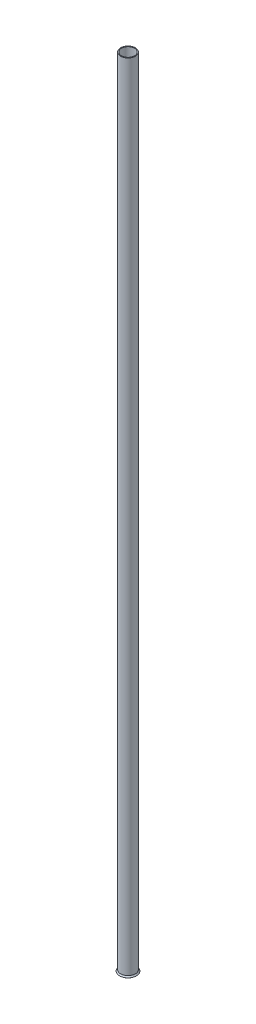
ISO-10303-21;
HEADER;
FILE_DESCRIPTION(('STEP AP214'),'2;1');
FILE_NAME('part.step','',(''),(''),'','','');
FILE_SCHEMA(('AUTOMOTIVE_DESIGN { 1 0 10303 214 1 1 1 1 }'));
ENDSEC;
DATA;
#1=APPLICATION_CONTEXT('core data for automotive mechanical design processes');
#2=APPLICATION_PROTOCOL_DEFINITION('international standard','automotive_design',2000,#1);
#3=PRODUCT_CONTEXT('',#1,'mechanical');
#4=PRODUCT('Part','Part','',(#3));
#5=PRODUCT_RELATED_PRODUCT_CATEGORY('part','',(#4));
#6=PRODUCT_DEFINITION_FORMATION('','',#4);
#7=PRODUCT_DEFINITION_CONTEXT('part definition',#1,'design');
#8=PRODUCT_DEFINITION('design','',#6,#7);
#9=PRODUCT_DEFINITION_SHAPE('','',#8);
#10=(LENGTH_UNIT() NAMED_UNIT(*) SI_UNIT(.MILLI.,.METRE.));
#11=(NAMED_UNIT(*) PLANE_ANGLE_UNIT() SI_UNIT($,.RADIAN.));
#12=(NAMED_UNIT(*) SI_UNIT($,.STERADIAN.) SOLID_ANGLE_UNIT());
#13=UNCERTAINTY_MEASURE_WITH_UNIT(LENGTH_MEASURE(1.E-05),#10,'distance_accuracy_value','');
#14=(GEOMETRIC_REPRESENTATION_CONTEXT(3) GLOBAL_UNCERTAINTY_ASSIGNED_CONTEXT((#13)) GLOBAL_UNIT_ASSIGNED_CONTEXT((#10,
#11,#12)) REPRESENTATION_CONTEXT('',''));
#15=CARTESIAN_POINT('',(0.,0.,0.));
#16=DIRECTION('',(0.,0.,1.));
#17=DIRECTION('',(1.,0.,0.));
#18=AXIS2_PLACEMENT_3D('',#15,#16,#17);
#19=CARTESIAN_POINT('',(0.,3085.846,0.));
#20=DIRECTION('',(0.,1.,0.));
#21=DIRECTION('',(0.,0.,1.));
#22=AXIS2_PLACEMENT_3D('',#19,#20,#21);
#23=PLANE('',#22);
#24=CARTESIAN_POINT('',(0.,3085.846,0.));
#25=DIRECTION('',(0.,1.,0.));
#26=DIRECTION('',(0.,0.,1.));
#27=AXIS2_PLACEMENT_3D('',#24,#25,#26);
#28=CIRCLE('',#27,28.575);
#29=CARTESIAN_POINT('',(0.,3085.846,28.575));
#30=VERTEX_POINT('',#29);
#31=EDGE_CURVE('E10',#30,#30,#28,.T.);
#32=ORIENTED_EDGE('',*,*,#31,.T.);
#33=EDGE_LOOP('',(#32));
#34=FACE_BOUND('',#33,.T.);
#35=CARTESIAN_POINT('',(0.,3085.846,0.));
#36=DIRECTION('',(0.,1.,0.));
#37=DIRECTION('',(0.,0.,1.));
#38=AXIS2_PLACEMENT_3D('',#35,#36,#37);
#39=CIRCLE('',#38,25.4);
#40=CARTESIAN_POINT('',(0.,3085.846,25.4));
#41=VERTEX_POINT('',#40);
#42=EDGE_CURVE('E47',#41,#41,#39,.T.);
#43=ORIENTED_EDGE('',*,*,#42,.F.);
#44=EDGE_LOOP('',(#43));
#45=FACE_BOUND('',#44,.T.);
#46=ADVANCED_FACE('F39',(#34,#45),#23,.T.);
#47=CARTESIAN_POINT('',(0.,3085.846,0.));
#48=DIRECTION('',(0.,-1.,0.));
#49=DIRECTION('',(0.,0.,-1.));
#50=AXIS2_PLACEMENT_3D('',#47,#48,#49);
#51=CYLINDRICAL_SURFACE('',#50,28.575);
#52=ORIENTED_EDGE('',*,*,#31,.F.);
#53=EDGE_LOOP('',(#52));
#54=FACE_BOUND('',#53,.T.);
#55=CARTESIAN_POINT('',(0.,0.,0.));
#56=DIRECTION('',(0.,-1.,0.));
#57=DIRECTION('',(0.,0.,-1.));
#58=AXIS2_PLACEMENT_3D('',#55,#56,#57);
#59=CIRCLE('',#58,28.575);
#60=CARTESIAN_POINT('',(0.,0.,-28.575));
#61=VERTEX_POINT('',#60);
#62=EDGE_CURVE('E67',#61,#61,#59,.T.);
#63=ORIENTED_EDGE('',*,*,#62,.F.);
#64=EDGE_LOOP('',(#63));
#65=FACE_BOUND('',#64,.T.);
#66=ADVANCED_FACE('F41',(#54,#65),#51,.T.);
#67=CARTESIAN_POINT('',(0.,3085.846,0.));
#68=DIRECTION('',(0.,-1.,0.));
#69=DIRECTION('',(0.,0.,-1.));
#70=AXIS2_PLACEMENT_3D('',#67,#68,#69);
#71=CYLINDRICAL_SURFACE('',#70,25.4);
#72=ORIENTED_EDGE('',*,*,#42,.T.);
#73=EDGE_LOOP('',(#72));
#74=FACE_BOUND('',#73,.T.);
#75=CARTESIAN_POINT('',(0.,0.,0.));
#76=DIRECTION('',(0.,1.,0.));
#77=DIRECTION('',(0.,0.,1.));
#78=AXIS2_PLACEMENT_3D('',#75,#76,#77);
#79=CIRCLE('',#78,25.4);
#80=CARTESIAN_POINT('',(0.,0.,25.4));
#81=VERTEX_POINT('',#80);
#82=EDGE_CURVE('E52',#81,#81,#79,.T.);
#83=ORIENTED_EDGE('',*,*,#82,.F.);
#84=EDGE_LOOP('',(#83));
#85=FACE_BOUND('',#84,.T.);
#86=ADVANCED_FACE('F76',(#74,#85),#71,.F.);
#87=CARTESIAN_POINT('',(0.,0.,0.));
#88=DIRECTION('',(0.,-1.,0.));
#89=DIRECTION('',(0.,0.,-1.));
#90=AXIS2_PLACEMENT_3D('',#87,#88,#89);
#91=CONICAL_SURFACE('',#90,25.4,0.698131700797729);
#92=CARTESIAN_POINT('',(0.,-6.4277645217124,0.));
#93=DIRECTION('',(0.,-1.,0.));
#94=DIRECTION('',(0.,0.,-1.));
#95=AXIS2_PLACEMENT_3D('',#92,#93,#94);
#96=CIRCLE('',#95,30.7935348394632);
#97=CARTESIAN_POINT('',(0.,-6.4277645217124,-30.7935348394632));
#98=VERTEX_POINT('',#97);
#99=EDGE_CURVE('E58',#98,#98,#96,.T.);
#100=ORIENTED_EDGE('',*,*,#99,.T.);
#101=EDGE_LOOP('',(#100));
#102=FACE_BOUND('',#101,.T.);
#103=ORIENTED_EDGE('',*,*,#82,.T.);
#104=EDGE_LOOP('',(#103));
#105=FACE_BOUND('',#104,.T.);
#106=ADVANCED_FACE('F82',(#102,#105),#91,.F.);
#107=CARTESIAN_POINT('',(0.,-6.4277645217124,0.));
#108=DIRECTION('',(0.,1.,0.));
#109=DIRECTION('',(0.,0.,1.));
#110=AXIS2_PLACEMENT_3D('',#107,#108,#109);
#111=CONICAL_SURFACE('',#110,30.7935348394632,0.872664625997169);
#112=CARTESIAN_POINT('',(0.,-4.86438221380553,0.));
#113=DIRECTION('',(0.,-1.,0.));
#114=DIRECTION('',(0.,0.,-1.));
#115=AXIS2_PLACEMENT_3D('',#112,#113,#114);
#116=CIRCLE('',#115,32.6567013215095);
#117=CARTESIAN_POINT('',(0.,-4.86438221380553,-32.6567013215095));
#118=VERTEX_POINT('',#117);
#119=EDGE_CURVE('E63',#118,#118,#116,.T.);
#120=ORIENTED_EDGE('',*,*,#119,.T.);
#121=EDGE_LOOP('',(#120));
#122=FACE_BOUND('',#121,.T.);
#123=ORIENTED_EDGE('',*,*,#99,.F.);
#124=EDGE_LOOP('',(#123));
#125=FACE_BOUND('',#124,.T.);
#126=ADVANCED_FACE('F90',(#122,#125),#111,.T.);
#127=CARTESIAN_POINT('',(0.,-4.86438221380553,0.));
#128=DIRECTION('',(0.,-1.,0.));
#129=DIRECTION('',(0.,0.,-1.));
#130=AXIS2_PLACEMENT_3D('',#127,#128,#129);
#131=CONICAL_SURFACE('',#130,32.6567013215095,0.698131700797729);
#132=ORIENTED_EDGE('',*,*,#62,.T.);
#133=EDGE_LOOP('',(#132));
#134=FACE_BOUND('',#133,.T.);
#135=ORIENTED_EDGE('',*,*,#119,.F.);
#136=EDGE_LOOP('',(#135));
#137=FACE_BOUND('',#136,.T.);
#138=ADVANCED_FACE('F72',(#134,#137),#131,.T.);
#139=CLOSED_SHELL('',(#46,#66,#86,#106,#126,#138));
#140=MANIFOLD_SOLID_BREP('B2',#139);
#141=ADVANCED_BREP_SHAPE_REPRESENTATION('',(#18,#140),#14);
#142=SHAPE_DEFINITION_REPRESENTATION(#9,#141);
ENDSEC;
END-ISO-10303-21;
